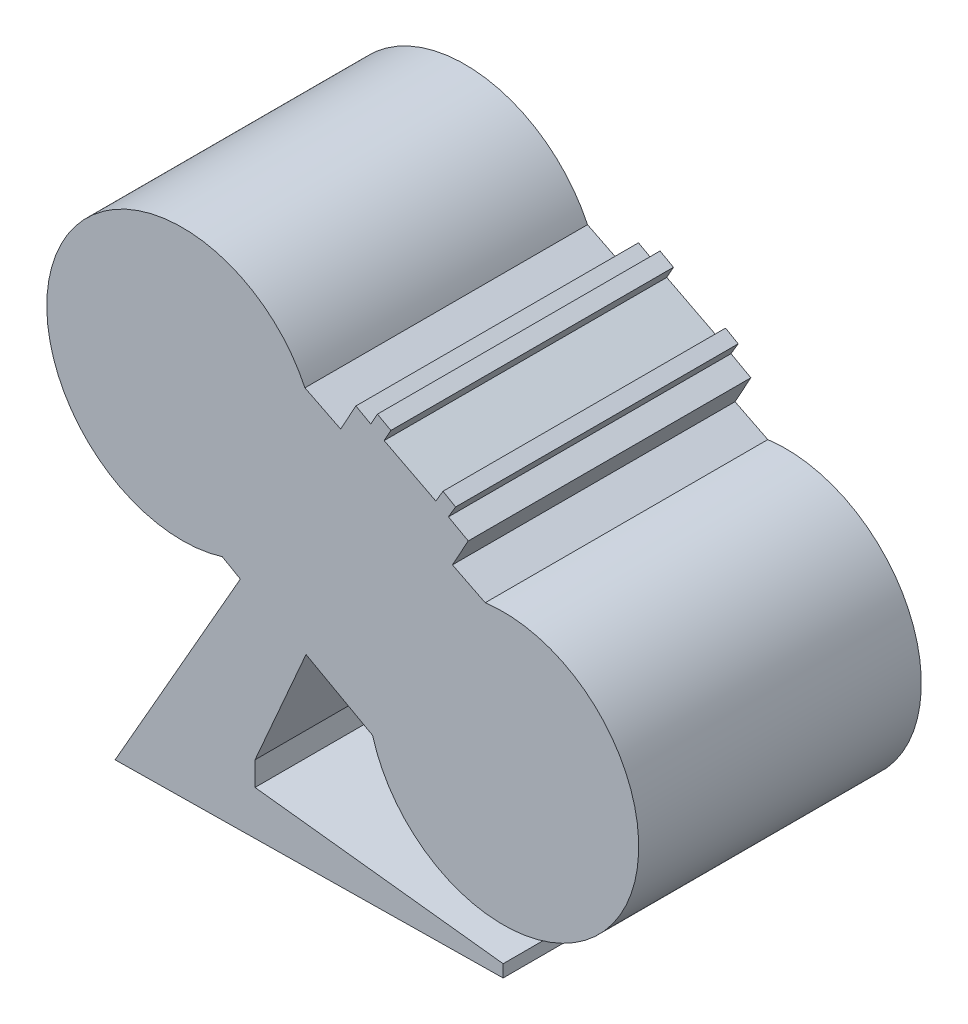
ISO-10303-21;
HEADER;
FILE_DESCRIPTION(('STEP AP214'),'2;1');
FILE_NAME('part.step','',(''),(''),'','','');
FILE_SCHEMA(('AUTOMOTIVE_DESIGN { 1 0 10303 214 1 1 1 1 }'));
ENDSEC;
DATA;
#1=APPLICATION_CONTEXT('core data for automotive mechanical design processes');
#2=APPLICATION_PROTOCOL_DEFINITION('international standard','automotive_design',2000,#1);
#3=PRODUCT_CONTEXT('',#1,'mechanical');
#4=PRODUCT('Part','Part','',(#3));
#5=PRODUCT_RELATED_PRODUCT_CATEGORY('part','',(#4));
#6=PRODUCT_DEFINITION_FORMATION('','',#4);
#7=PRODUCT_DEFINITION_CONTEXT('part definition',#1,'design');
#8=PRODUCT_DEFINITION('design','',#6,#7);
#9=PRODUCT_DEFINITION_SHAPE('','',#8);
#10=(LENGTH_UNIT() NAMED_UNIT(*) SI_UNIT(.MILLI.,.METRE.));
#11=(NAMED_UNIT(*) PLANE_ANGLE_UNIT() SI_UNIT($,.RADIAN.));
#12=(NAMED_UNIT(*) SI_UNIT($,.STERADIAN.) SOLID_ANGLE_UNIT());
#13=UNCERTAINTY_MEASURE_WITH_UNIT(LENGTH_MEASURE(1.E-05),#10,'distance_accuracy_value','');
#14=(GEOMETRIC_REPRESENTATION_CONTEXT(3) GLOBAL_UNCERTAINTY_ASSIGNED_CONTEXT((#13)) GLOBAL_UNIT_ASSIGNED_CONTEXT((#10,
#11,#12)) REPRESENTATION_CONTEXT('',''));
#15=CARTESIAN_POINT('',(0.,0.,0.));
#16=DIRECTION('',(0.,0.,1.));
#17=DIRECTION('',(1.,0.,0.));
#18=AXIS2_PLACEMENT_3D('',#15,#16,#17);
#19=CARTESIAN_POINT('',(100.652828051389,264.261906094761,208.));
#20=DIRECTION('',(0.,0.,-1.));
#21=DIRECTION('',(-1.,0.,0.));
#22=AXIS2_PLACEMENT_3D('',#19,#20,#21);
#23=CYLINDRICAL_SURFACE('',#22,99.7906497168601);
#24=CARTESIAN_POINT('',(100.652828051389,264.261906094761,0.));
#25=DIRECTION('',(0.,0.,1.));
#26=DIRECTION('',(1.,0.,0.));
#27=AXIS2_PLACEMENT_3D('',#24,#25,#26);
#28=CIRCLE('',#27,99.7906497168601);
#29=CARTESIAN_POINT('',(190.848647813832,306.957197032918,0.));
#30=VERTEX_POINT('',#29);
#31=CARTESIAN_POINT('',(130.025963152911,168.892137796726,0.));
#32=VERTEX_POINT('',#31);
#33=EDGE_CURVE('E224',#30,#32,#28,.T.);
#34=ORIENTED_EDGE('',*,*,#33,.T.);
#35=DIRECTION('',(0.,0.,-1.));
#36=VECTOR('',#35,1.);
#37=CARTESIAN_POINT('',(130.025963152911,168.892137796726,208.));
#38=LINE('',#37,#36);
#39=CARTESIAN_POINT('',(130.025963152911,168.892137796726,208.));
#40=VERTEX_POINT('',#39);
#41=EDGE_CURVE('E11',#40,#32,#38,.T.);
#42=ORIENTED_EDGE('',*,*,#41,.F.);
#43=CARTESIAN_POINT('',(100.652828051389,264.261906094761,208.));
#44=DIRECTION('',(0.,0.,1.));
#45=DIRECTION('',(1.,0.,0.));
#46=AXIS2_PLACEMENT_3D('',#43,#44,#45);
#47=CIRCLE('',#46,99.7906497168601);
#48=CARTESIAN_POINT('',(190.848647813832,306.957197032918,208.));
#49=VERTEX_POINT('',#48);
#50=EDGE_CURVE('E140',#49,#40,#47,.T.);
#51=ORIENTED_EDGE('',*,*,#50,.F.);
#52=DIRECTION('',(0.,0.,-1.));
#53=VECTOR('',#52,1.);
#54=CARTESIAN_POINT('',(190.848647813832,306.957197032918,208.));
#55=LINE('',#54,#53);
#56=EDGE_CURVE('E220',#49,#30,#55,.T.);
#57=ORIENTED_EDGE('',*,*,#56,.T.);
#58=EDGE_LOOP('',(#34,#42,#51,#57));
#59=FACE_BOUND('',#58,.T.);
#60=ADVANCED_FACE('F39',(#59),#23,.T.);
#61=CARTESIAN_POINT('',(104.745814130812,183.3355442891,208.));
#62=DIRECTION('',(-0.496076979352678,-0.868278544337198,0.));
#63=DIRECTION('',(0.868278544337198,-0.496076979352678,0.));
#64=AXIS2_PLACEMENT_3D('',#61,#62,#63);
#65=PLANE('',#64);
#66=DIRECTION('',(-0.868278544337198,0.496076979352678,0.));
#67=VECTOR('',#66,1.);
#68=CARTESIAN_POINT('',(104.745814130812,183.3355442891,0.));
#69=LINE('',#68,#67);
#70=CARTESIAN_POINT('',(143.317282356777,161.298356371091,0.));
#71=VERTEX_POINT('',#70);
#72=EDGE_CURVE('E227',#71,#32,#69,.T.);
#73=ORIENTED_EDGE('',*,*,#72,.F.);
#74=DIRECTION('',(0.,0.,-1.));
#75=VECTOR('',#74,1.);
#76=CARTESIAN_POINT('',(143.317282356777,161.298356371091,208.));
#77=LINE('',#76,#75);
#78=CARTESIAN_POINT('',(143.317282356777,161.298356371091,208.));
#79=VERTEX_POINT('',#78);
#80=EDGE_CURVE('E47',#79,#71,#77,.T.);
#81=ORIENTED_EDGE('',*,*,#80,.F.);
#82=DIRECTION('',(-0.868278544337198,0.496076979352678,0.));
#83=VECTOR('',#82,1.);
#84=CARTESIAN_POINT('',(104.745814130812,183.3355442891,208.));
#85=LINE('',#84,#83);
#86=EDGE_CURVE('E345',#79,#40,#85,.T.);
#87=ORIENTED_EDGE('',*,*,#86,.T.);
#88=ORIENTED_EDGE('',*,*,#41,.T.);
#89=EDGE_LOOP('',(#73,#81,#87,#88));
#90=FACE_BOUND('',#89,.T.);
#91=ADVANCED_FACE('F332',(#90),#65,.T.);
#92=CARTESIAN_POINT('',(38.5714682259651,-22.0371879180095,208.));
#93=DIRECTION('',(-0.868278544337197,0.496076979352678,0.));
#94=DIRECTION('',(-0.496076979352678,-0.868278544337198,0.));
#95=AXIS2_PLACEMENT_3D('',#92,#93,#94);
#96=PLANE('',#95);
#97=DIRECTION('',(0.496076979352678,0.868278544337197,0.));
#98=VECTOR('',#97,1.);
#99=CARTESIAN_POINT('',(38.5714682259651,-22.0371879180095,0.));
#100=LINE('',#99,#98);
#101=CARTESIAN_POINT('',(51.1620610571384,0.,0.));
#102=VERTEX_POINT('',#101);
#103=EDGE_CURVE('E230',#102,#71,#100,.T.);
#104=ORIENTED_EDGE('',*,*,#103,.F.);
#105=DIRECTION('',(0.,0.,-1.));
#106=VECTOR('',#105,1.);
#107=CARTESIAN_POINT('',(51.1620610571384,0.,208.));
#108=LINE('',#107,#106);
#109=CARTESIAN_POINT('',(51.1620610571384,0.,208.));
#110=VERTEX_POINT('',#109);
#111=EDGE_CURVE('E322',#110,#102,#108,.T.);
#112=ORIENTED_EDGE('',*,*,#111,.F.);
#113=DIRECTION('',(0.496076979352678,0.868278544337197,0.));
#114=VECTOR('',#113,1.);
#115=CARTESIAN_POINT('',(38.5714682259651,-22.0371879180095,208.));
#116=LINE('',#115,#114);
#117=EDGE_CURVE('E329',#110,#79,#116,.T.);
#118=ORIENTED_EDGE('',*,*,#117,.T.);
#119=ORIENTED_EDGE('',*,*,#80,.T.);
#120=EDGE_LOOP('',(#104,#112,#118,#119));
#121=FACE_BOUND('',#120,.T.);
#122=ADVANCED_FACE('F327',(#121),#96,.T.);
#123=CARTESIAN_POINT('',(0.00870056355614445,-0.667130470061727,208.));
#124=DIRECTION('',(0.0130406631251204,-0.999914966937318,0.));
#125=DIRECTION('',(0.999914966937318,0.0130406631251204,0.));
#126=AXIS2_PLACEMENT_3D('',#123,#124,#125);
#127=PLANE('',#126);
#128=DIRECTION('',(-0.999914966937318,-0.0130406631251204,0.));
#129=VECTOR('',#128,1.);
#130=CARTESIAN_POINT('',(0.00870056355614445,-0.667130470061727,0.));
#131=LINE('',#130,#129);
#132=CARTESIAN_POINT('',(336.72947520787,3.72430513652355,0.));
#133=VERTEX_POINT('',#132);
#134=EDGE_CURVE('E233',#133,#102,#131,.T.);
#135=ORIENTED_EDGE('',*,*,#134,.F.);
#136=DIRECTION('',(0.,0.,-1.));
#137=VECTOR('',#136,1.);
#138=CARTESIAN_POINT('',(336.72947520787,3.72430513652355,208.));
#139=LINE('',#138,#137);
#140=CARTESIAN_POINT('',(336.72947520787,3.72430513652355,208.));
#141=VERTEX_POINT('',#140);
#142=EDGE_CURVE('E320',#141,#133,#139,.T.);
#143=ORIENTED_EDGE('',*,*,#142,.F.);
#144=DIRECTION('',(-0.999914966937318,-0.0130406631251204,0.));
#145=VECTOR('',#144,1.);
#146=CARTESIAN_POINT('',(0.00870056355614445,-0.667130470061727,208.));
#147=LINE('',#146,#145);
#148=EDGE_CURVE('E344',#141,#110,#147,.T.);
#149=ORIENTED_EDGE('',*,*,#148,.T.);
#150=ORIENTED_EDGE('',*,*,#111,.T.);
#151=EDGE_LOOP('',(#135,#143,#149,#150));
#152=FACE_BOUND('',#151,.T.);
#153=ADVANCED_FACE('F340',(#152),#127,.T.);
#154=CARTESIAN_POINT('',(336.72947520787,0.,208.));
#155=DIRECTION('',(-1.,0.,0.));
#156=DIRECTION('',(0.,0.,1.));
#157=AXIS2_PLACEMENT_3D('',#154,#155,#156);
#158=PLANE('',#157);
#159=DIRECTION('',(0.,1.,0.));
#160=VECTOR('',#159,1.);
#161=CARTESIAN_POINT('',(336.72947520787,0.,0.));
#162=LINE('',#161,#160);
#163=CARTESIAN_POINT('',(336.72947520787,12.8260553883397,0.));
#164=VERTEX_POINT('',#163);
#165=EDGE_CURVE('E236',#133,#164,#162,.T.);
#166=ORIENTED_EDGE('',*,*,#165,.T.);
#167=DIRECTION('',(0.,0.,-1.));
#168=VECTOR('',#167,1.);
#169=CARTESIAN_POINT('',(336.72947520787,12.8260553883397,208.));
#170=LINE('',#169,#168);
#171=CARTESIAN_POINT('',(336.72947520787,12.8260553883397,208.));
#172=VERTEX_POINT('',#171);
#173=EDGE_CURVE('E317',#172,#164,#170,.T.);
#174=ORIENTED_EDGE('',*,*,#173,.F.);
#175=DIRECTION('',(0.,1.,0.));
#176=VECTOR('',#175,1.);
#177=CARTESIAN_POINT('',(336.72947520787,0.,208.));
#178=LINE('',#177,#176);
#179=EDGE_CURVE('E347',#141,#172,#178,.T.);
#180=ORIENTED_EDGE('',*,*,#179,.F.);
#181=ORIENTED_EDGE('',*,*,#142,.T.);
#182=EDGE_LOOP('',(#166,#174,#180,#181));
#183=FACE_BOUND('',#182,.T.);
#184=ADVANCED_FACE('F412',(#183),#158,.F.);
#185=CARTESIAN_POINT('',(5.87412806634314,50.9620299809768,208.));
#186=DIRECTION('',(-0.114506641305953,-0.993422482681376,0.));
#187=DIRECTION('',(0.993422482681376,-0.114506641305953,0.));
#188=AXIS2_PLACEMENT_3D('',#185,#186,#187);
#189=PLANE('',#188);
#190=DIRECTION('',(-0.993422482681377,0.114506641305953,0.));
#191=VECTOR('',#190,1.);
#192=CARTESIAN_POINT('',(5.87412806634314,50.9620299809768,0.));
#193=LINE('',#192,#191);
#194=CARTESIAN_POINT('',(154.125610780809,33.8738528456646,0.));
#195=VERTEX_POINT('',#194);
#196=EDGE_CURVE('E238',#164,#195,#193,.T.);
#197=ORIENTED_EDGE('',*,*,#196,.T.);
#198=DIRECTION('',(0.,0.,-1.));
#199=VECTOR('',#198,1.);
#200=CARTESIAN_POINT('',(154.125610780809,33.8738528456646,208.));
#201=LINE('',#200,#199);
#202=CARTESIAN_POINT('',(154.125610780809,33.8738528456646,208.));
#203=VERTEX_POINT('',#202);
#204=EDGE_CURVE('E314',#203,#195,#201,.T.);
#205=ORIENTED_EDGE('',*,*,#204,.F.);
#206=DIRECTION('',(-0.993422482681377,0.114506641305953,0.));
#207=VECTOR('',#206,1.);
#208=CARTESIAN_POINT('',(5.87412806634314,50.9620299809768,208.));
#209=LINE('',#208,#207);
#210=EDGE_CURVE('E353',#172,#203,#209,.T.);
#211=ORIENTED_EDGE('',*,*,#210,.F.);
#212=ORIENTED_EDGE('',*,*,#173,.T.);
#213=EDGE_LOOP('',(#197,#205,#211,#212));
#214=FACE_BOUND('',#213,.T.);
#215=ADVANCED_FACE('F415',(#214),#189,.F.);
#216=CARTESIAN_POINT('',(154.125610780809,0.,208.));
#217=DIRECTION('',(-1.,0.,0.));
#218=DIRECTION('',(0.,0.,1.));
#219=AXIS2_PLACEMENT_3D('',#216,#217,#218);
#220=PLANE('',#219);
#221=DIRECTION('',(0.,1.,0.));
#222=VECTOR('',#221,1.);
#223=CARTESIAN_POINT('',(154.125610780809,0.,0.));
#224=LINE('',#223,#222);
#225=CARTESIAN_POINT('',(154.125610780809,51.5084939585584,0.));
#226=VERTEX_POINT('',#225);
#227=EDGE_CURVE('E240',#195,#226,#224,.T.);
#228=ORIENTED_EDGE('',*,*,#227,.T.);
#229=DIRECTION('',(0.,0.,-1.));
#230=VECTOR('',#229,1.);
#231=CARTESIAN_POINT('',(154.125610780809,51.5084939585584,208.));
#232=LINE('',#231,#230);
#233=CARTESIAN_POINT('',(154.125610780809,51.5084939585584,208.));
#234=VERTEX_POINT('',#233);
#235=EDGE_CURVE('E311',#234,#226,#232,.T.);
#236=ORIENTED_EDGE('',*,*,#235,.F.);
#237=DIRECTION('',(0.,1.,0.));
#238=VECTOR('',#237,1.);
#239=CARTESIAN_POINT('',(154.125610780809,0.,208.));
#240=LINE('',#239,#238);
#241=EDGE_CURVE('E355',#203,#234,#240,.T.);
#242=ORIENTED_EDGE('',*,*,#241,.F.);
#243=ORIENTED_EDGE('',*,*,#204,.T.);
#244=EDGE_LOOP('',(#228,#236,#242,#243));
#245=FACE_BOUND('',#244,.T.);
#246=ADVANCED_FACE('F419',(#245),#220,.F.);
#247=CARTESIAN_POINT('',(110.501321965689,-48.2985910578509,208.));
#248=DIRECTION('',(-0.91629654951102,0.40050047859422,0.));
#249=DIRECTION('',(-0.40050047859422,-0.91629654951102,0.));
#250=AXIS2_PLACEMENT_3D('',#247,#248,#249);
#251=PLANE('',#250);
#252=DIRECTION('',(0.40050047859422,0.91629654951102,0.));
#253=VECTOR('',#252,1.);
#254=CARTESIAN_POINT('',(110.501321965689,-48.2985910578509,0.));
#255=LINE('',#254,#253);
#256=CARTESIAN_POINT('',(191.67033056955,137.406261960073,0.));
#257=VERTEX_POINT('',#256);
#258=EDGE_CURVE('E242',#226,#257,#255,.T.);
#259=ORIENTED_EDGE('',*,*,#258,.T.);
#260=DIRECTION('',(0.,0.,-1.));
#261=VECTOR('',#260,1.);
#262=CARTESIAN_POINT('',(191.67033056955,137.406261960073,208.));
#263=LINE('',#262,#261);
#264=CARTESIAN_POINT('',(191.67033056955,137.406261960073,208.));
#265=VERTEX_POINT('',#264);
#266=EDGE_CURVE('E308',#265,#257,#263,.T.);
#267=ORIENTED_EDGE('',*,*,#266,.F.);
#268=DIRECTION('',(0.40050047859422,0.91629654951102,0.));
#269=VECTOR('',#268,1.);
#270=CARTESIAN_POINT('',(110.501321965689,-48.2985910578509,208.));
#271=LINE('',#270,#269);
#272=EDGE_CURVE('E357',#234,#265,#271,.T.);
#273=ORIENTED_EDGE('',*,*,#272,.F.);
#274=ORIENTED_EDGE('',*,*,#235,.T.);
#275=EDGE_LOOP('',(#259,#267,#273,#274));
#276=FACE_BOUND('',#275,.T.);
#277=ADVANCED_FACE('F423',(#276),#251,.F.);
#278=CARTESIAN_POINT('',(102.933472617519,186.406627719216,208.));
#279=DIRECTION('',(0.483395707071713,0.87540195932191,0.));
#280=DIRECTION('',(-0.87540195932191,0.483395707071713,0.));
#281=AXIS2_PLACEMENT_3D('',#278,#279,#280);
#282=PLANE('',#281);
#283=DIRECTION('',(0.87540195932191,-0.483395707071713,0.));
#284=VECTOR('',#283,1.);
#285=CARTESIAN_POINT('',(102.933472617519,186.406627719216,0.));
#286=LINE('',#285,#284);
#287=CARTESIAN_POINT('',(240.662425477453,110.352897380818,0.));
#288=VERTEX_POINT('',#287);
#289=EDGE_CURVE('E244',#257,#288,#286,.T.);
#290=ORIENTED_EDGE('',*,*,#289,.T.);
#291=DIRECTION('',(0.,0.,-1.));
#292=VECTOR('',#291,1.);
#293=CARTESIAN_POINT('',(240.662425477453,110.352897380818,208.));
#294=LINE('',#293,#292);
#295=CARTESIAN_POINT('',(240.662425477453,110.352897380818,208.));
#296=VERTEX_POINT('',#295);
#297=EDGE_CURVE('E305',#296,#288,#294,.T.);
#298=ORIENTED_EDGE('',*,*,#297,.F.);
#299=DIRECTION('',(0.87540195932191,-0.483395707071713,0.));
#300=VECTOR('',#299,1.);
#301=CARTESIAN_POINT('',(102.933472617519,186.406627719216,208.));
#302=LINE('',#301,#300);
#303=EDGE_CURVE('E359',#265,#296,#302,.T.);
#304=ORIENTED_EDGE('',*,*,#303,.F.);
#305=ORIENTED_EDGE('',*,*,#266,.T.);
#306=EDGE_LOOP('',(#290,#298,#304,#305));
#307=FACE_BOUND('',#306,.T.);
#308=ADVANCED_FACE('F427',(#307),#282,.F.);
#309=CARTESIAN_POINT('',(336.72947520787,137.406261960073,208.));
#310=DIRECTION('',(0.,0.,-1.));
#311=DIRECTION('',(-1.,0.,0.));
#312=AXIS2_PLACEMENT_3D('',#309,#310,#311);
#313=CYLINDRICAL_SURFACE('',#312,99.803620069437);
#314=CARTESIAN_POINT('',(336.72947520787,137.406261960073,0.));
#315=DIRECTION('',(0.,0.,1.));
#316=DIRECTION('',(1.,0.,0.));
#317=AXIS2_PLACEMENT_3D('',#314,#315,#316);
#318=CIRCLE('',#317,99.803620069437);
#319=CARTESIAN_POINT('',(323.548842254495,236.335698903346,0.));
#320=VERTEX_POINT('',#319);
#321=EDGE_CURVE('E246',#288,#320,#318,.T.);
#322=ORIENTED_EDGE('',*,*,#321,.T.);
#323=DIRECTION('',(0.,0.,-1.));
#324=VECTOR('',#323,1.);
#325=CARTESIAN_POINT('',(323.548842254495,236.335698903346,208.));
#326=LINE('',#325,#324);
#327=CARTESIAN_POINT('',(323.548842254495,236.335698903346,208.));
#328=VERTEX_POINT('',#327);
#329=EDGE_CURVE('E303',#328,#320,#326,.T.);
#330=ORIENTED_EDGE('',*,*,#329,.F.);
#331=CARTESIAN_POINT('',(336.72947520787,137.406261960073,208.));
#332=DIRECTION('',(0.,0.,1.));
#333=DIRECTION('',(1.,0.,0.));
#334=AXIS2_PLACEMENT_3D('',#331,#332,#333);
#335=CIRCLE('',#334,99.803620069437);
#336=EDGE_CURVE('E361',#296,#328,#335,.T.);
#337=ORIENTED_EDGE('',*,*,#336,.F.);
#338=ORIENTED_EDGE('',*,*,#297,.T.);
#339=EDGE_LOOP('',(#322,#330,#337,#338));
#340=FACE_BOUND('',#339,.T.);
#341=ADVANCED_FACE('F431',(#340),#313,.T.);
#342=CARTESIAN_POINT('',(159.194111332654,318.48745901712,208.));
#343=DIRECTION('',(0.447102108550282,0.894482925790029,0.));
#344=DIRECTION('',(-0.89448292579003,0.447102108550283,0.));
#345=AXIS2_PLACEMENT_3D('',#342,#343,#344);
#346=PLANE('',#345);
#347=DIRECTION('',(0.89448292579003,-0.447102108550282,0.));
#348=VECTOR('',#347,1.);
#349=CARTESIAN_POINT('',(159.194111332654,318.48745901712,0.));
#350=LINE('',#349,#348);
#351=CARTESIAN_POINT('',(299.418472531826,248.397124417504,0.));
#352=VERTEX_POINT('',#351);
#353=EDGE_CURVE('E249',#352,#320,#350,.T.);
#354=ORIENTED_EDGE('',*,*,#353,.F.);
#355=DIRECTION('',(0.,0.,-1.));
#356=VECTOR('',#355,1.);
#357=CARTESIAN_POINT('',(299.418472531826,248.397124417504,208.));
#358=LINE('',#357,#356);
#359=CARTESIAN_POINT('',(299.418472531826,248.397124417504,208.));
#360=VERTEX_POINT('',#359);
#361=EDGE_CURVE('E301',#360,#352,#358,.T.);
#362=ORIENTED_EDGE('',*,*,#361,.F.);
#363=DIRECTION('',(0.89448292579003,-0.447102108550282,0.));
#364=VECTOR('',#363,1.);
#365=CARTESIAN_POINT('',(159.194111332654,318.48745901712,208.));
#366=LINE('',#365,#364);
#367=EDGE_CURVE('E363',#360,#328,#366,.T.);
#368=ORIENTED_EDGE('',*,*,#367,.T.);
#369=ORIENTED_EDGE('',*,*,#329,.T.);
#370=EDGE_LOOP('',(#354,#362,#368,#369));
#371=FACE_BOUND('',#370,.T.);
#372=ADVANCED_FACE('F435',(#371),#346,.T.);
#373=CARTESIAN_POINT('',(124.39853012895,-68.6679886311811,208.));
#374=DIRECTION('',(0.875475512339869,-0.483262482811611,0.));
#375=DIRECTION('',(0.483262482811612,0.87547551233987,0.));
#376=AXIS2_PLACEMENT_3D('',#373,#374,#375);
#377=PLANE('',#376);
#378=DIRECTION('',(-0.483262482811611,-0.875475512339869,0.));
#379=VECTOR('',#378,1.);
#380=CARTESIAN_POINT('',(124.39853012895,-68.6679886311811,0.));
#381=LINE('',#380,#379);
#382=CARTESIAN_POINT('',(311.058094028532,269.48339524487,0.));
#383=VERTEX_POINT('',#382);
#384=EDGE_CURVE('E252',#383,#352,#381,.T.);
#385=ORIENTED_EDGE('',*,*,#384,.F.);
#386=DIRECTION('',(0.,0.,-1.));
#387=VECTOR('',#386,1.);
#388=CARTESIAN_POINT('',(311.058094028532,269.48339524487,208.));
#389=LINE('',#388,#387);
#390=CARTESIAN_POINT('',(311.058094028532,269.48339524487,208.));
#391=VERTEX_POINT('',#390);
#392=EDGE_CURVE('E299',#391,#383,#389,.T.);
#393=ORIENTED_EDGE('',*,*,#392,.F.);
#394=DIRECTION('',(-0.483262482811611,-0.875475512339869,0.));
#395=VECTOR('',#394,1.);
#396=CARTESIAN_POINT('',(124.39853012895,-68.6679886311811,208.));
#397=LINE('',#396,#395);
#398=EDGE_CURVE('E366',#391,#360,#397,.T.);
#399=ORIENTED_EDGE('',*,*,#398,.T.);
#400=ORIENTED_EDGE('',*,*,#361,.T.);
#401=EDGE_LOOP('',(#385,#393,#399,#400));
#402=FACE_BOUND('',#401,.T.);
#403=ADVANCED_FACE('F439',(#402),#377,.T.);
#404=CARTESIAN_POINT('',(186.659563899582,338.151383876051,208.));
#405=DIRECTION('',(0.483262482811612,0.875475512339869,0.));
#406=DIRECTION('',(-0.875475512339869,0.483262482811612,0.));
#407=AXIS2_PLACEMENT_3D('',#404,#405,#406);
#408=PLANE('',#407);
#409=DIRECTION('',(0.875475512339869,-0.483262482811613,0.));
#410=VECTOR('',#409,1.);
#411=CARTESIAN_POINT('',(186.659563899582,338.151383876051,0.));
#412=LINE('',#411,#410);
#413=CARTESIAN_POINT('',(296.467383180977,277.53746763272,0.));
#414=VERTEX_POINT('',#413);
#415=EDGE_CURVE('E255',#414,#383,#412,.T.);
#416=ORIENTED_EDGE('',*,*,#415,.F.);
#417=DIRECTION('',(0.,0.,-1.));
#418=VECTOR('',#417,1.);
#419=CARTESIAN_POINT('',(296.467383180977,277.53746763272,208.));
#420=LINE('',#419,#418);
#421=CARTESIAN_POINT('',(296.467383180977,277.53746763272,208.));
#422=VERTEX_POINT('',#421);
#423=EDGE_CURVE('E297',#422,#414,#420,.T.);
#424=ORIENTED_EDGE('',*,*,#423,.F.);
#425=DIRECTION('',(0.875475512339869,-0.483262482811613,0.));
#426=VECTOR('',#425,1.);
#427=CARTESIAN_POINT('',(186.659563899582,338.151383876051,208.));
#428=LINE('',#427,#426);
#429=EDGE_CURVE('E369',#422,#391,#428,.T.);
#430=ORIENTED_EDGE('',*,*,#429,.T.);
#431=ORIENTED_EDGE('',*,*,#392,.T.);
#432=EDGE_LOOP('',(#416,#424,#430,#431));
#433=FACE_BOUND('',#432,.T.);
#434=ADVANCED_FACE('F443',(#433),#408,.T.);
#435=CARTESIAN_POINT('',(98.8049682661061,-58.1748878576143,208.));
#436=DIRECTION('',(-0.86172711182537,0.507372037803726,0.));
#437=DIRECTION('',(-0.507372037803726,-0.86172711182537,0.));
#438=AXIS2_PLACEMENT_3D('',#435,#436,#437);
#439=PLANE('',#438);
#440=DIRECTION('',(0.507372037803726,0.86172711182537,0.));
#441=VECTOR('',#440,1.);
#442=CARTESIAN_POINT('',(98.8049682661061,-58.1748878576143,0.));
#443=LINE('',#442,#441);
#444=CARTESIAN_POINT('',(301.70688463371,286.436303433393,0.));
#445=VERTEX_POINT('',#444);
#446=EDGE_CURVE('E258',#414,#445,#443,.T.);
#447=ORIENTED_EDGE('',*,*,#446,.T.);
#448=DIRECTION('',(0.,0.,-1.));
#449=VECTOR('',#448,1.);
#450=CARTESIAN_POINT('',(301.70688463371,286.436303433393,208.));
#451=LINE('',#450,#449);
#452=CARTESIAN_POINT('',(301.70688463371,286.436303433393,208.));
#453=VERTEX_POINT('',#452);
#454=EDGE_CURVE('E294',#453,#445,#451,.T.);
#455=ORIENTED_EDGE('',*,*,#454,.F.);
#456=DIRECTION('',(0.507372037803726,0.86172711182537,0.));
#457=VECTOR('',#456,1.);
#458=CARTESIAN_POINT('',(98.8049682661061,-58.1748878576143,208.));
#459=LINE('',#458,#457);
#460=EDGE_CURVE('E372',#422,#453,#459,.T.);
#461=ORIENTED_EDGE('',*,*,#460,.F.);
#462=ORIENTED_EDGE('',*,*,#423,.T.);
#463=EDGE_LOOP('',(#447,#455,#461,#462));
#464=FACE_BOUND('',#463,.T.);
#465=ADVANCED_FACE('F447',(#464),#439,.F.);
#466=CARTESIAN_POINT('',(202.901916367604,344.611191291008,208.));
#467=DIRECTION('',(-0.507372037803726,-0.861727111825371,0.));
#468=DIRECTION('',(0.861727111825371,-0.507372037803726,0.));
#469=AXIS2_PLACEMENT_3D('',#466,#467,#468);
#470=PLANE('',#469);
#471=DIRECTION('',(-0.861727111825371,0.507372037803726,0.));
#472=VECTOR('',#471,1.);
#473=CARTESIAN_POINT('',(202.901916367604,344.611191291008,0.));
#474=LINE('',#473,#472);
#475=CARTESIAN_POINT('',(292.477329354908,291.870527569511,0.));
#476=VERTEX_POINT('',#475);
#477=EDGE_CURVE('E260',#445,#476,#474,.T.);
#478=ORIENTED_EDGE('',*,*,#477,.T.);
#479=DIRECTION('',(0.,0.,-1.));
#480=VECTOR('',#479,1.);
#481=CARTESIAN_POINT('',(292.477329354908,291.870527569511,208.));
#482=LINE('',#481,#480);
#483=CARTESIAN_POINT('',(292.477329354908,291.870527569511,208.));
#484=VERTEX_POINT('',#483);
#485=EDGE_CURVE('E291',#484,#476,#482,.T.);
#486=ORIENTED_EDGE('',*,*,#485,.F.);
#487=DIRECTION('',(-0.861727111825371,0.507372037803726,0.));
#488=VECTOR('',#487,1.);
#489=CARTESIAN_POINT('',(202.901916367604,344.611191291008,208.));
#490=LINE('',#489,#488);
#491=EDGE_CURVE('E374',#453,#484,#490,.T.);
#492=ORIENTED_EDGE('',*,*,#491,.F.);
#493=ORIENTED_EDGE('',*,*,#454,.T.);
#494=EDGE_LOOP('',(#478,#486,#492,#493));
#495=FACE_BOUND('',#494,.T.);
#496=ADVANCED_FACE('F451',(#495),#470,.F.);
#497=CARTESIAN_POINT('',(89.5754129873039,-52.740663721497,208.));
#498=DIRECTION('',(0.86172711182537,-0.507372037803726,0.));
#499=DIRECTION('',(0.507372037803726,0.86172711182537,0.));
#500=AXIS2_PLACEMENT_3D('',#497,#498,#499);
#501=PLANE('',#500);
#502=DIRECTION('',(-0.507372037803726,-0.86172711182537,0.));
#503=VECTOR('',#502,1.);
#504=CARTESIAN_POINT('',(89.5754129873039,-52.740663721497,0.));
#505=LINE('',#504,#503);
#506=CARTESIAN_POINT('',(287.237827902175,282.971691768837,0.));
#507=VERTEX_POINT('',#506);
#508=EDGE_CURVE('E262',#476,#507,#505,.T.);
#509=ORIENTED_EDGE('',*,*,#508,.T.);
#510=DIRECTION('',(0.,0.,-1.));
#511=VECTOR('',#510,1.);
#512=CARTESIAN_POINT('',(287.237827902175,282.971691768837,208.));
#513=LINE('',#512,#511);
#514=CARTESIAN_POINT('',(287.237827902175,282.971691768837,208.));
#515=VERTEX_POINT('',#514);
#516=EDGE_CURVE('E289',#515,#507,#513,.T.);
#517=ORIENTED_EDGE('',*,*,#516,.F.);
#518=DIRECTION('',(-0.507372037803726,-0.86172711182537,0.));
#519=VECTOR('',#518,1.);
#520=CARTESIAN_POINT('',(89.5754129873039,-52.740663721497,208.));
#521=LINE('',#520,#519);
#522=EDGE_CURVE('E376',#484,#515,#521,.T.);
#523=ORIENTED_EDGE('',*,*,#522,.F.);
#524=ORIENTED_EDGE('',*,*,#485,.T.);
#525=EDGE_LOOP('',(#509,#517,#523,#524));
#526=FACE_BOUND('',#525,.T.);
#527=ADVANCED_FACE('F455',(#526),#501,.F.);
#528=CARTESIAN_POINT('',(174.560799776267,340.702403257798,208.));
#529=DIRECTION('',(0.455989039481831,0.889985390819668,0.));
#530=DIRECTION('',(-0.889985390819668,0.455989039481831,0.));
#531=AXIS2_PLACEMENT_3D('',#528,#529,#530);
#532=PLANE('',#531);
#533=DIRECTION('',(0.889985390819668,-0.455989039481831,0.));
#534=VECTOR('',#533,1.);
#535=CARTESIAN_POINT('',(174.560799776267,340.702403257798,0.));
#536=LINE('',#535,#534);
#537=CARTESIAN_POINT('',(249.158038274421,302.482086967614,0.));
#538=VERTEX_POINT('',#537);
#539=EDGE_CURVE('E265',#538,#507,#536,.T.);
#540=ORIENTED_EDGE('',*,*,#539,.F.);
#541=DIRECTION('',(0.,0.,-1.));
#542=VECTOR('',#541,1.);
#543=CARTESIAN_POINT('',(249.158038274421,302.482086967614,208.));
#544=LINE('',#543,#542);
#545=CARTESIAN_POINT('',(249.158038274421,302.482086967614,208.));
#546=VERTEX_POINT('',#545);
#547=EDGE_CURVE('E287',#546,#538,#544,.T.);
#548=ORIENTED_EDGE('',*,*,#547,.F.);
#549=DIRECTION('',(0.889985390819668,-0.455989039481831,0.));
#550=VECTOR('',#549,1.);
#551=CARTESIAN_POINT('',(174.560799776267,340.702403257798,208.));
#552=LINE('',#551,#550);
#553=EDGE_CURVE('E378',#546,#515,#552,.T.);
#554=ORIENTED_EDGE('',*,*,#553,.T.);
#555=ORIENTED_EDGE('',*,*,#516,.T.);
#556=EDGE_LOOP('',(#540,#548,#554,#555));
#557=FACE_BOUND('',#556,.T.);
#558=ADVANCED_FACE('F459',(#557),#532,.T.);
#559=CARTESIAN_POINT('',(62.993542035815,-34.7724352037702,208.));
#560=DIRECTION('',(0.875475512339869,-0.483262482811612,0.));
#561=DIRECTION('',(0.483262482811612,0.875475512339869,0.));
#562=AXIS2_PLACEMENT_3D('',#559,#560,#561);
#563=PLANE('',#562);
#564=DIRECTION('',(-0.483262482811612,-0.875475512339869,0.));
#565=VECTOR('',#564,1.);
#566=CARTESIAN_POINT('',(62.993542035815,-34.7724352037702,0.));
#567=LINE('',#566,#565);
#568=CARTESIAN_POINT('',(254.098559786517,311.432307098223,0.));
#569=VERTEX_POINT('',#568);
#570=EDGE_CURVE('E268',#569,#538,#567,.T.);
#571=ORIENTED_EDGE('',*,*,#570,.F.);
#572=DIRECTION('',(0.,0.,-1.));
#573=VECTOR('',#572,1.);
#574=CARTESIAN_POINT('',(254.098559786517,311.432307098223,208.));
#575=LINE('',#574,#573);
#576=CARTESIAN_POINT('',(254.098559786517,311.432307098223,208.));
#577=VERTEX_POINT('',#576);
#578=EDGE_CURVE('E285',#577,#569,#575,.T.);
#579=ORIENTED_EDGE('',*,*,#578,.F.);
#580=DIRECTION('',(-0.483262482811612,-0.875475512339869,0.));
#581=VECTOR('',#580,1.);
#582=CARTESIAN_POINT('',(62.993542035815,-34.7724352037702,208.));
#583=LINE('',#582,#581);
#584=EDGE_CURVE('E381',#577,#546,#583,.T.);
#585=ORIENTED_EDGE('',*,*,#584,.T.);
#586=ORIENTED_EDGE('',*,*,#547,.T.);
#587=EDGE_LOOP('',(#571,#579,#585,#586));
#588=FACE_BOUND('',#587,.T.);
#589=ADVANCED_FACE('F463',(#588),#563,.T.);
#590=CARTESIAN_POINT('',(191.105017750703,346.204742301992,208.));
#591=DIRECTION('',(0.483262482811615,0.875475512339868,0.));
#592=DIRECTION('',(-0.875475512339868,0.483262482811615,0.));
#593=AXIS2_PLACEMENT_3D('',#590,#591,#592);
#594=PLANE('',#593);
#595=DIRECTION('',(0.875475512339868,-0.483262482811615,0.));
#596=VECTOR('',#595,1.);
#597=CARTESIAN_POINT('',(191.105017750703,346.204742301992,0.));
#598=LINE('',#597,#596);
#599=CARTESIAN_POINT('',(244.217516762325,316.886642847576,0.));
#600=VERTEX_POINT('',#599);
#601=EDGE_CURVE('E271',#600,#569,#598,.T.);
#602=ORIENTED_EDGE('',*,*,#601,.F.);
#603=DIRECTION('',(0.,0.,-1.));
#604=VECTOR('',#603,1.);
#605=CARTESIAN_POINT('',(244.217516762325,316.886642847576,208.));
#606=LINE('',#605,#604);
#607=CARTESIAN_POINT('',(244.217516762325,316.886642847576,208.));
#608=VERTEX_POINT('',#607);
#609=EDGE_CURVE('E283',#608,#600,#606,.T.);
#610=ORIENTED_EDGE('',*,*,#609,.F.);
#611=DIRECTION('',(0.875475512339868,-0.483262482811615,0.));
#612=VECTOR('',#611,1.);
#613=CARTESIAN_POINT('',(191.105017750703,346.204742301992,208.));
#614=LINE('',#613,#612);
#615=EDGE_CURVE('E384',#608,#577,#614,.T.);
#616=ORIENTED_EDGE('',*,*,#615,.T.);
#617=ORIENTED_EDGE('',*,*,#578,.T.);
#618=EDGE_LOOP('',(#602,#610,#616,#617));
#619=FACE_BOUND('',#618,.T.);
#620=ADVANCED_FACE('F467',(#619),#594,.T.);
#621=CARTESIAN_POINT('',(53.1124990116233,-29.3180994544163,208.));
#622=DIRECTION('',(-0.875475512339869,0.483262482811612,0.));
#623=DIRECTION('',(-0.483262482811612,-0.875475512339869,0.));
#624=AXIS2_PLACEMENT_3D('',#621,#622,#623);
#625=PLANE('',#624);
#626=DIRECTION('',(0.483262482811612,0.875475512339869,0.));
#627=VECTOR('',#626,1.);
#628=CARTESIAN_POINT('',(53.1124990116233,-29.3180994544163,0.));
#629=LINE('',#628,#627);
#630=CARTESIAN_POINT('',(239.358147450799,308.083437573074,0.));
#631=VERTEX_POINT('',#630);
#632=EDGE_CURVE('E274',#631,#600,#629,.T.);
#633=ORIENTED_EDGE('',*,*,#632,.F.);
#634=DIRECTION('',(0.,0.,-1.));
#635=VECTOR('',#634,1.);
#636=CARTESIAN_POINT('',(239.358147450799,308.083437573074,208.));
#637=LINE('',#636,#635);
#638=CARTESIAN_POINT('',(239.358147450799,308.083437573074,208.));
#639=VERTEX_POINT('',#638);
#640=EDGE_CURVE('E215',#639,#631,#637,.T.);
#641=ORIENTED_EDGE('',*,*,#640,.F.);
#642=DIRECTION('',(0.483262482811612,0.875475512339869,0.));
#643=VECTOR('',#642,1.);
#644=CARTESIAN_POINT('',(53.1124990116233,-29.3180994544163,208.));
#645=LINE('',#644,#643);
#646=EDGE_CURVE('E208',#639,#608,#645,.T.);
#647=ORIENTED_EDGE('',*,*,#646,.T.);
#648=ORIENTED_EDGE('',*,*,#609,.T.);
#649=EDGE_LOOP('',(#633,#641,#647,#648));
#650=FACE_BOUND('',#649,.T.);
#651=ADVANCED_FACE('F388',(#650),#625,.T.);
#652=CARTESIAN_POINT('',(186.245648439176,337.40153702749,208.));
#653=DIRECTION('',(-0.483262482811612,-0.875475512339869,0.));
#654=DIRECTION('',(0.875475512339869,-0.483262482811612,0.));
#655=AXIS2_PLACEMENT_3D('',#652,#653,#654);
#656=PLANE('',#655);
#657=DIRECTION('',(-0.875475512339869,0.483262482811612,0.));
#658=VECTOR('',#657,1.);
#659=CARTESIAN_POINT('',(186.245648439176,337.40153702749,0.));
#660=LINE('',#659,#658);
#661=CARTESIAN_POINT('',(228.35083332068,314.1594749729,0.));
#662=VERTEX_POINT('',#661);
#663=EDGE_CURVE('E214',#631,#662,#660,.T.);
#664=ORIENTED_EDGE('',*,*,#663,.T.);
#665=DIRECTION('',(0.,0.,-1.));
#666=VECTOR('',#665,1.);
#667=CARTESIAN_POINT('',(228.35083332068,314.1594749729,208.));
#668=LINE('',#667,#666);
#669=CARTESIAN_POINT('',(228.35083332068,314.1594749729,208.));
#670=VERTEX_POINT('',#669);
#671=EDGE_CURVE('E211',#670,#662,#668,.T.);
#672=ORIENTED_EDGE('',*,*,#671,.F.);
#673=DIRECTION('',(-0.875475512339869,0.483262482811612,0.));
#674=VECTOR('',#673,1.);
#675=CARTESIAN_POINT('',(186.245648439176,337.40153702749,208.));
#676=LINE('',#675,#674);
#677=EDGE_CURVE('E201',#639,#670,#676,.T.);
#678=ORIENTED_EDGE('',*,*,#677,.F.);
#679=ORIENTED_EDGE('',*,*,#640,.T.);
#680=EDGE_LOOP('',(#664,#672,#678,#679));
#681=FACE_BOUND('',#680,.T.);
#682=ADVANCED_FACE('F212',(#681),#656,.F.);
#683=CARTESIAN_POINT('',(42.1051848815037,-23.2420620545903,208.));
#684=DIRECTION('',(0.875475512339869,-0.483262482811613,0.));
#685=DIRECTION('',(0.483262482811613,0.875475512339869,0.));
#686=AXIS2_PLACEMENT_3D('',#683,#684,#685);
#687=PLANE('',#686);
#688=DIRECTION('',(-0.483262482811613,-0.875475512339869,0.));
#689=VECTOR('',#688,1.);
#690=CARTESIAN_POINT('',(42.1051848815037,-23.2420620545903,0.));
#691=LINE('',#690,#689);
#692=CARTESIAN_POINT('',(217.12512728438,293.823050994095,0.));
#693=VERTEX_POINT('',#692);
#694=EDGE_CURVE('E128',#662,#693,#691,.T.);
#695=ORIENTED_EDGE('',*,*,#694,.T.);
#696=DIRECTION('',(0.,0.,-1.));
#697=VECTOR('',#696,1.);
#698=CARTESIAN_POINT('',(217.12512728438,293.823050994095,208.));
#699=LINE('',#698,#697);
#700=CARTESIAN_POINT('',(217.12512728438,293.823050994095,208.));
#701=VERTEX_POINT('',#700);
#702=EDGE_CURVE('E216',#701,#693,#699,.T.);
#703=ORIENTED_EDGE('',*,*,#702,.F.);
#704=DIRECTION('',(-0.483262482811613,-0.875475512339869,0.));
#705=VECTOR('',#704,1.);
#706=CARTESIAN_POINT('',(42.1051848815037,-23.2420620545903,208.));
#707=LINE('',#706,#705);
#708=EDGE_CURVE('E205',#670,#701,#707,.T.);
#709=ORIENTED_EDGE('',*,*,#708,.F.);
#710=ORIENTED_EDGE('',*,*,#671,.T.);
#711=EDGE_LOOP('',(#695,#703,#709,#710));
#712=FACE_BOUND('',#711,.T.);
#713=ADVANCED_FACE('F218',(#712),#687,.F.);
#714=CARTESIAN_POINT('',(160.910620172957,321.921546712651,208.));
#715=DIRECTION('',(-0.447102108550283,-0.894482925790029,0.));
#716=DIRECTION('',(0.894482925790029,-0.447102108550283,0.));
#717=AXIS2_PLACEMENT_3D('',#714,#715,#716);
#718=PLANE('',#717);
#719=DIRECTION('',(-0.894482925790029,0.447102108550283,0.));
#720=VECTOR('',#719,1.);
#721=CARTESIAN_POINT('',(160.910620172957,321.921546712651,0.));
#722=LINE('',#721,#720);
#723=EDGE_CURVE('E134',#693,#30,#722,.T.);
#724=ORIENTED_EDGE('',*,*,#723,.T.);
#725=ORIENTED_EDGE('',*,*,#56,.F.);
#726=DIRECTION('',(-0.894482925790029,0.447102108550283,0.));
#727=VECTOR('',#726,1.);
#728=CARTESIAN_POINT('',(160.910620172957,321.921546712651,208.));
#729=LINE('',#728,#727);
#730=EDGE_CURVE('E55',#701,#49,#729,.T.);
#731=ORIENTED_EDGE('',*,*,#730,.F.);
#732=ORIENTED_EDGE('',*,*,#702,.T.);
#733=EDGE_LOOP('',(#724,#725,#731,#732));
#734=FACE_BOUND('',#733,.T.);
#735=ADVANCED_FACE('F391',(#734),#718,.F.);
#736=CARTESIAN_POINT('',(0.,0.,208.));
#737=DIRECTION('',(0.,0.,1.));
#738=DIRECTION('',(1.,0.,0.));
#739=AXIS2_PLACEMENT_3D('',#736,#737,#738);
#740=PLANE('',#739);
#741=ORIENTED_EDGE('',*,*,#50,.T.);
#742=ORIENTED_EDGE('',*,*,#86,.F.);
#743=ORIENTED_EDGE('',*,*,#117,.F.);
#744=ORIENTED_EDGE('',*,*,#148,.F.);
#745=ORIENTED_EDGE('',*,*,#179,.T.);
#746=ORIENTED_EDGE('',*,*,#210,.T.);
#747=ORIENTED_EDGE('',*,*,#241,.T.);
#748=ORIENTED_EDGE('',*,*,#272,.T.);
#749=ORIENTED_EDGE('',*,*,#303,.T.);
#750=ORIENTED_EDGE('',*,*,#336,.T.);
#751=ORIENTED_EDGE('',*,*,#367,.F.);
#752=ORIENTED_EDGE('',*,*,#398,.F.);
#753=ORIENTED_EDGE('',*,*,#429,.F.);
#754=ORIENTED_EDGE('',*,*,#460,.T.);
#755=ORIENTED_EDGE('',*,*,#491,.T.);
#756=ORIENTED_EDGE('',*,*,#522,.T.);
#757=ORIENTED_EDGE('',*,*,#553,.F.);
#758=ORIENTED_EDGE('',*,*,#584,.F.);
#759=ORIENTED_EDGE('',*,*,#615,.F.);
#760=ORIENTED_EDGE('',*,*,#646,.F.);
#761=ORIENTED_EDGE('',*,*,#677,.T.);
#762=ORIENTED_EDGE('',*,*,#708,.T.);
#763=ORIENTED_EDGE('',*,*,#730,.T.);
#764=EDGE_LOOP('',(#741,#742,#743,#744,#745,#746,#747,#748,#749,#750,#751,#752,#753,#754,#755,
#756,#757,#758,#759,#760,#761,#762,#763));
#765=FACE_BOUND('',#764,.T.);
#766=ADVANCED_FACE('F203',(#765),#740,.T.);
#767=CARTESIAN_POINT('',(0.,0.,0.));
#768=DIRECTION('',(0.,0.,1.));
#769=DIRECTION('',(1.,0.,0.));
#770=AXIS2_PLACEMENT_3D('',#767,#768,#769);
#771=PLANE('',#770);
#772=ORIENTED_EDGE('',*,*,#33,.F.);
#773=ORIENTED_EDGE('',*,*,#723,.F.);
#774=ORIENTED_EDGE('',*,*,#694,.F.);
#775=ORIENTED_EDGE('',*,*,#663,.F.);
#776=ORIENTED_EDGE('',*,*,#632,.T.);
#777=ORIENTED_EDGE('',*,*,#601,.T.);
#778=ORIENTED_EDGE('',*,*,#570,.T.);
#779=ORIENTED_EDGE('',*,*,#539,.T.);
#780=ORIENTED_EDGE('',*,*,#508,.F.);
#781=ORIENTED_EDGE('',*,*,#477,.F.);
#782=ORIENTED_EDGE('',*,*,#446,.F.);
#783=ORIENTED_EDGE('',*,*,#415,.T.);
#784=ORIENTED_EDGE('',*,*,#384,.T.);
#785=ORIENTED_EDGE('',*,*,#353,.T.);
#786=ORIENTED_EDGE('',*,*,#321,.F.);
#787=ORIENTED_EDGE('',*,*,#289,.F.);
#788=ORIENTED_EDGE('',*,*,#258,.F.);
#789=ORIENTED_EDGE('',*,*,#227,.F.);
#790=ORIENTED_EDGE('',*,*,#196,.F.);
#791=ORIENTED_EDGE('',*,*,#165,.F.);
#792=ORIENTED_EDGE('',*,*,#134,.T.);
#793=ORIENTED_EDGE('',*,*,#103,.T.);
#794=ORIENTED_EDGE('',*,*,#72,.T.);
#795=EDGE_LOOP('',(#772,#773,#774,#775,#776,#777,#778,#779,#780,#781,#782,#783,#784,#785,#786,
#787,#788,#789,#790,#791,#792,#793,#794));
#796=FACE_BOUND('',#795,.T.);
#797=ADVANCED_FACE('F335',(#796),#771,.F.);
#798=CLOSED_SHELL('',(#60,#91,#122,#153,#184,#215,#246,#277,#308,#341,#372,#403,#434,#465,#496,
#527,#558,#589,#620,#651,#682,#713,#735,#766,#797));
#799=MANIFOLD_SOLID_BREP('B2',#798);
#800=ADVANCED_BREP_SHAPE_REPRESENTATION('',(#18,#799),#14);
#801=SHAPE_DEFINITION_REPRESENTATION(#9,#800);
ENDSEC;
END-ISO-10303-21;
